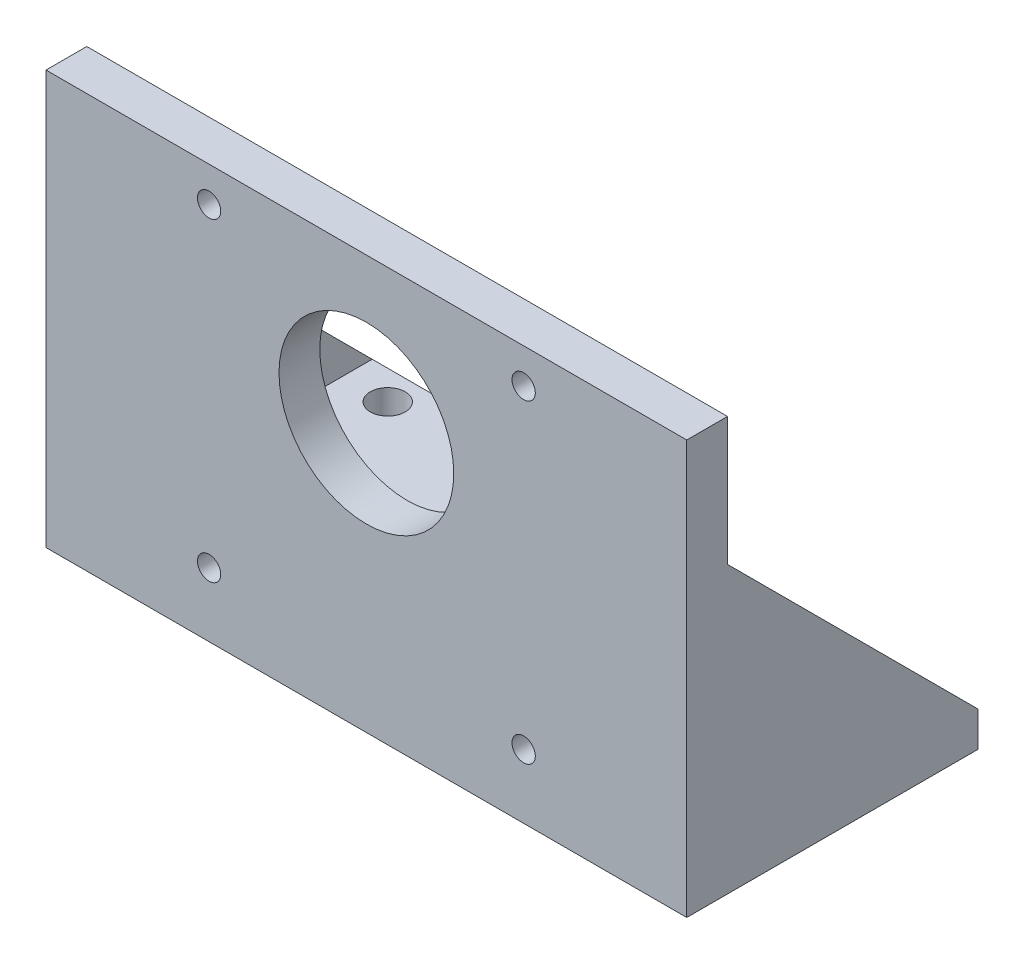
ISO-10303-21;
HEADER;
FILE_DESCRIPTION(('STEP AP214'),'2;1');
FILE_NAME('part.step','',(''),(''),'','','');
FILE_SCHEMA(('AUTOMOTIVE_DESIGN { 1 0 10303 214 1 1 1 1 }'));
ENDSEC;
DATA;
#1=APPLICATION_CONTEXT('core data for automotive mechanical design processes');
#2=APPLICATION_PROTOCOL_DEFINITION('international standard','automotive_design',2000,#1);
#3=PRODUCT_CONTEXT('',#1,'mechanical');
#4=PRODUCT('Part','Part','',(#3));
#5=PRODUCT_RELATED_PRODUCT_CATEGORY('part','',(#4));
#6=PRODUCT_DEFINITION_FORMATION('','',#4);
#7=PRODUCT_DEFINITION_CONTEXT('part definition',#1,'design');
#8=PRODUCT_DEFINITION('design','',#6,#7);
#9=PRODUCT_DEFINITION_SHAPE('','',#8);
#10=(LENGTH_UNIT() NAMED_UNIT(*) SI_UNIT(.MILLI.,.METRE.));
#11=(NAMED_UNIT(*) PLANE_ANGLE_UNIT() SI_UNIT($,.RADIAN.));
#12=(NAMED_UNIT(*) SI_UNIT($,.STERADIAN.) SOLID_ANGLE_UNIT());
#13=UNCERTAINTY_MEASURE_WITH_UNIT(LENGTH_MEASURE(1.E-05),#10,'distance_accuracy_value','');
#14=(GEOMETRIC_REPRESENTATION_CONTEXT(3) GLOBAL_UNCERTAINTY_ASSIGNED_CONTEXT((#13)) GLOBAL_UNIT_ASSIGNED_CONTEXT((#10,
#11,#12)) REPRESENTATION_CONTEXT('',''));
#15=CARTESIAN_POINT('',(0.,0.,0.));
#16=DIRECTION('',(0.,0.,1.));
#17=DIRECTION('',(1.,0.,0.));
#18=AXIS2_PLACEMENT_3D('',#15,#16,#17);
#19=CARTESIAN_POINT('',(0.,6.,0.));
#20=DIRECTION('',(0.,1.,0.));
#21=DIRECTION('',(0.,0.,1.));
#22=AXIS2_PLACEMENT_3D('',#19,#20,#21);
#23=PLANE('',#22);
#24=CARTESIAN_POINT('',(41.3296992436846,6.,-20.));
#25=DIRECTION('',(0.,1.,0.));
#26=DIRECTION('',(0.,0.,-1.));
#27=AXIS2_PLACEMENT_3D('',#24,#25,#26);
#28=CIRCLE('',#27,3.);
#29=CARTESIAN_POINT('',(41.3296992436846,6.,-23.));
#30=VERTEX_POINT('',#29);
#31=EDGE_CURVE('E222',#30,#30,#28,.T.);
#32=ORIENTED_EDGE('',*,*,#31,.F.);
#33=EDGE_LOOP('',(#32));
#34=FACE_BOUND('',#33,.T.);
#35=CARTESIAN_POINT('',(41.3296992436846,6.,13.));
#36=DIRECTION('',(0.,1.,0.));
#37=DIRECTION('',(0.,0.,-1.));
#38=AXIS2_PLACEMENT_3D('',#35,#36,#37);
#39=CIRCLE('',#38,3.);
#40=CARTESIAN_POINT('',(41.3296992436846,6.,10.));
#41=VERTEX_POINT('',#40);
#42=EDGE_CURVE('E216',#41,#41,#39,.T.);
#43=ORIENTED_EDGE('',*,*,#42,.F.);
#44=EDGE_LOOP('',(#43));
#45=FACE_BOUND('',#44,.T.);
#46=CARTESIAN_POINT('',(-41.3296992436846,6.,13.));
#47=DIRECTION('',(0.,1.,0.));
#48=DIRECTION('',(0.,0.,1.));
#49=AXIS2_PLACEMENT_3D('',#46,#47,#48);
#50=CIRCLE('',#49,3.);
#51=CARTESIAN_POINT('',(-41.3296992436846,6.,16.));
#52=VERTEX_POINT('',#51);
#53=EDGE_CURVE('E210',#52,#52,#50,.T.);
#54=ORIENTED_EDGE('',*,*,#53,.F.);
#55=EDGE_LOOP('',(#54));
#56=FACE_BOUND('',#55,.T.);
#57=CARTESIAN_POINT('',(-41.3296992436846,6.,-20.));
#58=DIRECTION('',(0.,1.,0.));
#59=DIRECTION('',(0.,0.,1.));
#60=AXIS2_PLACEMENT_3D('',#57,#58,#59);
#61=CIRCLE('',#60,3.);
#62=CARTESIAN_POINT('',(-41.3296992436846,6.,-17.));
#63=VERTEX_POINT('',#62);
#64=EDGE_CURVE('E204',#63,#63,#61,.T.);
#65=ORIENTED_EDGE('',*,*,#64,.F.);
#66=EDGE_LOOP('',(#65));
#67=FACE_BOUND('',#66,.T.);
#68=CARTESIAN_POINT('',(0.,6.,0.));
#69=DIRECTION('',(0.,1.,0.));
#70=DIRECTION('',(0.,0.,1.));
#71=AXIS2_PLACEMENT_3D('',#68,#69,#70);
#72=CIRCLE('',#71,17.5);
#73=CARTESIAN_POINT('',(0.,6.,17.5));
#74=VERTEX_POINT('',#73);
#75=EDGE_CURVE('E128',#74,#74,#72,.T.);
#76=ORIENTED_EDGE('',*,*,#75,.F.);
#77=EDGE_LOOP('',(#76));
#78=FACE_BOUND('',#77,.T.);
#79=DIRECTION('',(1.,0.,0.));
#80=VECTOR('',#79,1.);
#81=CARTESIAN_POINT('',(0.,6.,-25.));
#82=LINE('',#81,#80);
#83=CARTESIAN_POINT('',(-49.,6.,-25.));
#84=VERTEX_POINT('',#83);
#85=CARTESIAN_POINT('',(49.,6.,-25.));
#86=VERTEX_POINT('',#85);
#87=EDGE_CURVE('E51',#84,#86,#82,.T.);
#88=ORIENTED_EDGE('',*,*,#87,.F.);
#89=DIRECTION('',(0.,0.,1.));
#90=VECTOR('',#89,1.);
#91=CARTESIAN_POINT('',(-49.,6.,-25.));
#92=LINE('',#91,#90);
#93=CARTESIAN_POINT('',(-49.,6.,18.));
#94=VERTEX_POINT('',#93);
#95=EDGE_CURVE('E107',#84,#94,#92,.T.);
#96=ORIENTED_EDGE('',*,*,#95,.T.);
#97=DIRECTION('',(-1.,0.,0.));
#98=VECTOR('',#97,1.);
#99=CARTESIAN_POINT('',(-55.,6.,18.));
#100=LINE('',#99,#98);
#101=CARTESIAN_POINT('',(49.,6.,18.));
#102=VERTEX_POINT('',#101);
#103=EDGE_CURVE('E167',#102,#94,#100,.T.);
#104=ORIENTED_EDGE('',*,*,#103,.F.);
#105=DIRECTION('',(0.,0.,-1.));
#106=VECTOR('',#105,1.);
#107=CARTESIAN_POINT('',(49.,6.,18.));
#108=LINE('',#107,#106);
#109=EDGE_CURVE('E126',#102,#86,#108,.T.);
#110=ORIENTED_EDGE('',*,*,#109,.T.);
#111=EDGE_LOOP('',(#88,#96,#104,#110));
#112=FACE_BOUND('',#111,.T.);
#113=ADVANCED_FACE('F34',(#34,#45,#56,#67,#78,#112),#23,.T.);
#114=CARTESIAN_POINT('',(0.,6.,-25.));
#115=DIRECTION('',(0.,0.,-1.));
#116=DIRECTION('',(-1.,0.,0.));
#117=AXIS2_PLACEMENT_3D('',#114,#115,#116);
#118=PLANE('',#117);
#119=DIRECTION('',(1.,0.,0.));
#120=VECTOR('',#119,1.);
#121=CARTESIAN_POINT('',(0.,0.,-25.));
#122=LINE('',#121,#120);
#123=CARTESIAN_POINT('',(-55.,0.,-25.));
#124=VERTEX_POINT('',#123);
#125=CARTESIAN_POINT('',(55.,0.,-25.));
#126=VERTEX_POINT('',#125);
#127=EDGE_CURVE('E142',#124,#126,#122,.T.);
#128=ORIENTED_EDGE('',*,*,#127,.F.);
#129=DIRECTION('',(0.,-1.,0.));
#130=VECTOR('',#129,1.);
#131=CARTESIAN_POINT('',(-55.,6.,-25.));
#132=LINE('',#131,#130);
#133=CARTESIAN_POINT('',(-55.,6.,-25.));
#134=VERTEX_POINT('',#133);
#135=EDGE_CURVE('E11',#134,#124,#132,.T.);
#136=ORIENTED_EDGE('',*,*,#135,.F.);
#137=EDGE_CURVE('E119',#134,#84,#82,.T.);
#138=ORIENTED_EDGE('',*,*,#137,.T.);
#139=ORIENTED_EDGE('',*,*,#87,.T.);
#140=DIRECTION('',(1.,0.,0.));
#141=VECTOR('',#140,1.);
#142=CARTESIAN_POINT('',(49.,6.,-25.));
#143=LINE('',#142,#141);
#144=CARTESIAN_POINT('',(55.,6.,-25.));
#145=VERTEX_POINT('',#144);
#146=EDGE_CURVE('E182',#86,#145,#143,.T.);
#147=ORIENTED_EDGE('',*,*,#146,.T.);
#148=DIRECTION('',(0.,-1.,0.));
#149=VECTOR('',#148,1.);
#150=CARTESIAN_POINT('',(55.,6.,-25.));
#151=LINE('',#150,#149);
#152=EDGE_CURVE('E133',#145,#126,#151,.T.);
#153=ORIENTED_EDGE('',*,*,#152,.T.);
#154=EDGE_LOOP('',(#128,#136,#138,#139,#147,#153));
#155=FACE_BOUND('',#154,.T.);
#156=ADVANCED_FACE('F132',(#155),#118,.T.);
#157=CARTESIAN_POINT('',(-55.,6.,0.));
#158=DIRECTION('',(1.,0.,0.));
#159=DIRECTION('',(0.,0.,-1.));
#160=AXIS2_PLACEMENT_3D('',#157,#158,#159);
#161=PLANE('',#160);
#162=DIRECTION('',(0.,0.,1.));
#163=VECTOR('',#162,1.);
#164=CARTESIAN_POINT('',(-55.,0.,0.));
#165=LINE('',#164,#163);
#166=CARTESIAN_POINT('',(-55.,0.,25.));
#167=VERTEX_POINT('',#166);
#168=EDGE_CURVE('E146',#124,#167,#165,.T.);
#169=ORIENTED_EDGE('',*,*,#168,.T.);
#170=DIRECTION('',(0.,-1.,0.));
#171=VECTOR('',#170,1.);
#172=CARTESIAN_POINT('',(-55.,6.,25.));
#173=LINE('',#172,#171);
#174=CARTESIAN_POINT('',(-55.,71.,25.));
#175=VERTEX_POINT('',#174);
#176=EDGE_CURVE('E43',#175,#167,#173,.T.);
#177=ORIENTED_EDGE('',*,*,#176,.F.);
#178=DIRECTION('',(0.,0.,1.));
#179=VECTOR('',#178,1.);
#180=CARTESIAN_POINT('',(-55.,71.,25.));
#181=LINE('',#180,#179);
#182=CARTESIAN_POINT('',(-55.,71.,18.));
#183=VERTEX_POINT('',#182);
#184=EDGE_CURVE('E169',#183,#175,#181,.T.);
#185=ORIENTED_EDGE('',*,*,#184,.F.);
#186=DIRECTION('',(0.,-1.,0.));
#187=VECTOR('',#186,1.);
#188=CARTESIAN_POINT('',(-55.,71.,18.));
#189=LINE('',#188,#187);
#190=CARTESIAN_POINT('',(-55.,49.,18.));
#191=VERTEX_POINT('',#190);
#192=EDGE_CURVE('E158',#183,#191,#189,.T.);
#193=ORIENTED_EDGE('',*,*,#192,.T.);
#194=DIRECTION('',(0.,-0.707106781186547,-0.707106781186548));
#195=VECTOR('',#194,1.);
#196=CARTESIAN_POINT('',(-55.,49.,18.));
#197=LINE('',#196,#195);
#198=EDGE_CURVE('E123',#191,#134,#197,.T.);
#199=ORIENTED_EDGE('',*,*,#198,.T.);
#200=ORIENTED_EDGE('',*,*,#135,.T.);
#201=EDGE_LOOP('',(#169,#177,#185,#193,#199,#200));
#202=FACE_BOUND('',#201,.T.);
#203=ADVANCED_FACE('F264',(#202),#161,.F.);
#204=CARTESIAN_POINT('',(0.,6.,25.));
#205=DIRECTION('',(0.,0.,-1.));
#206=DIRECTION('',(-1.,0.,0.));
#207=AXIS2_PLACEMENT_3D('',#204,#205,#206);
#208=PLANE('',#207);
#209=CARTESIAN_POINT('',(27.,11.,25.));
#210=DIRECTION('',(0.,0.,1.));
#211=DIRECTION('',(1.,0.,0.));
#212=AXIS2_PLACEMENT_3D('',#209,#210,#211);
#213=CIRCLE('',#212,2.);
#214=CARTESIAN_POINT('',(29.,11.,25.));
#215=VERTEX_POINT('',#214);
#216=EDGE_CURVE('E238',#215,#215,#213,.T.);
#217=ORIENTED_EDGE('',*,*,#216,.F.);
#218=EDGE_LOOP('',(#217));
#219=FACE_BOUND('',#218,.T.);
#220=CARTESIAN_POINT('',(27.,65.,25.));
#221=DIRECTION('',(0.,0.,1.));
#222=DIRECTION('',(1.,0.,0.));
#223=AXIS2_PLACEMENT_3D('',#220,#221,#222);
#224=CIRCLE('',#223,2.);
#225=CARTESIAN_POINT('',(29.,65.,25.));
#226=VERTEX_POINT('',#225);
#227=EDGE_CURVE('E235',#226,#226,#224,.T.);
#228=ORIENTED_EDGE('',*,*,#227,.F.);
#229=EDGE_LOOP('',(#228));
#230=FACE_BOUND('',#229,.T.);
#231=CARTESIAN_POINT('',(-27.,65.,25.));
#232=DIRECTION('',(0.,0.,1.));
#233=DIRECTION('',(1.,0.,0.));
#234=AXIS2_PLACEMENT_3D('',#231,#232,#233);
#235=CIRCLE('',#234,2.);
#236=CARTESIAN_POINT('',(-25.,65.,25.));
#237=VERTEX_POINT('',#236);
#238=EDGE_CURVE('E231',#237,#237,#235,.T.);
#239=ORIENTED_EDGE('',*,*,#238,.F.);
#240=EDGE_LOOP('',(#239));
#241=FACE_BOUND('',#240,.T.);
#242=CARTESIAN_POINT('',(-27.,11.,25.));
#243=DIRECTION('',(0.,0.,1.));
#244=DIRECTION('',(1.,0.,0.));
#245=AXIS2_PLACEMENT_3D('',#242,#243,#244);
#246=CIRCLE('',#245,2.);
#247=CARTESIAN_POINT('',(-25.,11.,25.));
#248=VERTEX_POINT('',#247);
#249=EDGE_CURVE('E227',#248,#248,#246,.T.);
#250=ORIENTED_EDGE('',*,*,#249,.F.);
#251=EDGE_LOOP('',(#250));
#252=FACE_BOUND('',#251,.T.);
#253=CARTESIAN_POINT('',(0.,46.,25.));
#254=DIRECTION('',(0.,0.,1.));
#255=DIRECTION('',(1.,0.,0.));
#256=AXIS2_PLACEMENT_3D('',#253,#254,#255);
#257=CIRCLE('',#256,15.);
#258=CARTESIAN_POINT('',(15.,46.,25.));
#259=VERTEX_POINT('',#258);
#260=EDGE_CURVE('E200',#259,#259,#257,.T.);
#261=ORIENTED_EDGE('',*,*,#260,.F.);
#262=EDGE_LOOP('',(#261));
#263=FACE_BOUND('',#262,.T.);
#264=DIRECTION('',(1.,0.,0.));
#265=VECTOR('',#264,1.);
#266=CARTESIAN_POINT('',(0.,0.,25.));
#267=LINE('',#266,#265);
#268=CARTESIAN_POINT('',(55.,0.,25.));
#269=VERTEX_POINT('',#268);
#270=EDGE_CURVE('E149',#167,#269,#267,.T.);
#271=ORIENTED_EDGE('',*,*,#270,.T.);
#272=DIRECTION('',(0.,-1.,0.));
#273=VECTOR('',#272,1.);
#274=CARTESIAN_POINT('',(55.,6.,25.));
#275=LINE('',#274,#273);
#276=CARTESIAN_POINT('',(55.,71.,25.));
#277=VERTEX_POINT('',#276);
#278=EDGE_CURVE('E134',#277,#269,#275,.T.);
#279=ORIENTED_EDGE('',*,*,#278,.F.);
#280=DIRECTION('',(1.,0.,0.));
#281=VECTOR('',#280,1.);
#282=CARTESIAN_POINT('',(-55.,71.,25.));
#283=LINE('',#282,#281);
#284=EDGE_CURVE('E177',#175,#277,#283,.T.);
#285=ORIENTED_EDGE('',*,*,#284,.F.);
#286=ORIENTED_EDGE('',*,*,#176,.T.);
#287=EDGE_LOOP('',(#271,#279,#285,#286));
#288=FACE_BOUND('',#287,.T.);
#289=ADVANCED_FACE('F278',(#219,#230,#241,#252,#263,#288),#208,.F.);
#290=CARTESIAN_POINT('',(0.,6.,0.));
#291=DIRECTION('',(0.,-1.,0.));
#292=DIRECTION('',(0.,0.,-1.));
#293=AXIS2_PLACEMENT_3D('',#290,#291,#292);
#294=CYLINDRICAL_SURFACE('',#293,17.5);
#295=ORIENTED_EDGE('',*,*,#75,.T.);
#296=EDGE_LOOP('',(#295));
#297=FACE_BOUND('',#296,.T.);
#298=CARTESIAN_POINT('',(0.,0.,0.));
#299=DIRECTION('',(0.,1.,0.));
#300=DIRECTION('',(0.,0.,1.));
#301=AXIS2_PLACEMENT_3D('',#298,#299,#300);
#302=CIRCLE('',#301,17.5);
#303=CARTESIAN_POINT('',(0.,0.,17.5));
#304=VERTEX_POINT('',#303);
#305=EDGE_CURVE('E139',#304,#304,#302,.T.);
#306=ORIENTED_EDGE('',*,*,#305,.F.);
#307=EDGE_LOOP('',(#306));
#308=FACE_BOUND('',#307,.T.);
#309=ADVANCED_FACE('F36',(#297,#308),#294,.F.);
#310=CARTESIAN_POINT('',(55.,6.,0.));
#311=DIRECTION('',(1.,0.,0.));
#312=DIRECTION('',(0.,0.,-1.));
#313=AXIS2_PLACEMENT_3D('',#310,#311,#312);
#314=PLANE('',#313);
#315=DIRECTION('',(0.,0.,1.));
#316=VECTOR('',#315,1.);
#317=CARTESIAN_POINT('',(55.,0.,0.));
#318=LINE('',#317,#316);
#319=EDGE_CURVE('E152',#126,#269,#318,.T.);
#320=ORIENTED_EDGE('',*,*,#319,.F.);
#321=ORIENTED_EDGE('',*,*,#152,.F.);
#322=DIRECTION('',(0.,0.707106781186547,0.707106781186548));
#323=VECTOR('',#322,1.);
#324=CARTESIAN_POINT('',(55.,49.,18.));
#325=LINE('',#324,#323);
#326=CARTESIAN_POINT('',(55.,49.,18.));
#327=VERTEX_POINT('',#326);
#328=EDGE_CURVE('E186',#145,#327,#325,.T.);
#329=ORIENTED_EDGE('',*,*,#328,.T.);
#330=DIRECTION('',(0.,-1.,0.));
#331=VECTOR('',#330,1.);
#332=CARTESIAN_POINT('',(55.,71.,18.));
#333=LINE('',#332,#331);
#334=CARTESIAN_POINT('',(55.,71.,18.));
#335=VERTEX_POINT('',#334);
#336=EDGE_CURVE('E143',#335,#327,#333,.T.);
#337=ORIENTED_EDGE('',*,*,#336,.F.);
#338=DIRECTION('',(0.,0.,-1.));
#339=VECTOR('',#338,1.);
#340=CARTESIAN_POINT('',(55.,71.,25.));
#341=LINE('',#340,#339);
#342=EDGE_CURVE('E175',#277,#335,#341,.T.);
#343=ORIENTED_EDGE('',*,*,#342,.F.);
#344=ORIENTED_EDGE('',*,*,#278,.T.);
#345=EDGE_LOOP('',(#320,#321,#329,#337,#343,#344));
#346=FACE_BOUND('',#345,.T.);
#347=ADVANCED_FACE('F273',(#346),#314,.T.);
#348=CARTESIAN_POINT('',(0.,0.,0.));
#349=DIRECTION('',(0.,1.,0.));
#350=DIRECTION('',(0.,0.,1.));
#351=AXIS2_PLACEMENT_3D('',#348,#349,#350);
#352=PLANE('',#351);
#353=CARTESIAN_POINT('',(41.3296992436846,0.,-20.));
#354=DIRECTION('',(0.,1.,0.));
#355=DIRECTION('',(0.,0.,-1.));
#356=AXIS2_PLACEMENT_3D('',#353,#354,#355);
#357=CIRCLE('',#356,3.);
#358=CARTESIAN_POINT('',(41.3296992436846,0.,-23.));
#359=VERTEX_POINT('',#358);
#360=EDGE_CURVE('E219',#359,#359,#357,.T.);
#361=ORIENTED_EDGE('',*,*,#360,.T.);
#362=EDGE_LOOP('',(#361));
#363=FACE_BOUND('',#362,.T.);
#364=CARTESIAN_POINT('',(41.3296992436846,0.,13.));
#365=DIRECTION('',(0.,1.,0.));
#366=DIRECTION('',(0.,0.,-1.));
#367=AXIS2_PLACEMENT_3D('',#364,#365,#366);
#368=CIRCLE('',#367,3.);
#369=CARTESIAN_POINT('',(41.3296992436846,0.,10.));
#370=VERTEX_POINT('',#369);
#371=EDGE_CURVE('E213',#370,#370,#368,.T.);
#372=ORIENTED_EDGE('',*,*,#371,.T.);
#373=EDGE_LOOP('',(#372));
#374=FACE_BOUND('',#373,.T.);
#375=CARTESIAN_POINT('',(-41.3296992436846,0.,13.));
#376=DIRECTION('',(0.,1.,0.));
#377=DIRECTION('',(0.,0.,1.));
#378=AXIS2_PLACEMENT_3D('',#375,#376,#377);
#379=CIRCLE('',#378,3.);
#380=CARTESIAN_POINT('',(-41.3296992436846,0.,16.));
#381=VERTEX_POINT('',#380);
#382=EDGE_CURVE('E207',#381,#381,#379,.T.);
#383=ORIENTED_EDGE('',*,*,#382,.T.);
#384=EDGE_LOOP('',(#383));
#385=FACE_BOUND('',#384,.T.);
#386=CARTESIAN_POINT('',(-41.3296992436846,0.,-20.));
#387=DIRECTION('',(0.,1.,0.));
#388=DIRECTION('',(0.,0.,1.));
#389=AXIS2_PLACEMENT_3D('',#386,#387,#388);
#390=CIRCLE('',#389,3.);
#391=CARTESIAN_POINT('',(-41.3296992436846,0.,-17.));
#392=VERTEX_POINT('',#391);
#393=EDGE_CURVE('E203',#392,#392,#390,.T.);
#394=ORIENTED_EDGE('',*,*,#393,.T.);
#395=EDGE_LOOP('',(#394));
#396=FACE_BOUND('',#395,.T.);
#397=ORIENTED_EDGE('',*,*,#305,.T.);
#398=EDGE_LOOP('',(#397));
#399=FACE_BOUND('',#398,.T.);
#400=ORIENTED_EDGE('',*,*,#127,.T.);
#401=ORIENTED_EDGE('',*,*,#319,.T.);
#402=ORIENTED_EDGE('',*,*,#270,.F.);
#403=ORIENTED_EDGE('',*,*,#168,.F.);
#404=EDGE_LOOP('',(#400,#401,#402,#403));
#405=FACE_BOUND('',#404,.T.);
#406=ADVANCED_FACE('F270',(#363,#374,#385,#396,#399,#405),#352,.F.);
#407=CARTESIAN_POINT('',(-55.,71.,18.));
#408=DIRECTION('',(0.,0.,1.));
#409=DIRECTION('',(1.,0.,0.));
#410=AXIS2_PLACEMENT_3D('',#407,#408,#409);
#411=PLANE('',#410);
#412=CARTESIAN_POINT('',(27.,11.,18.));
#413=DIRECTION('',(0.,0.,1.));
#414=DIRECTION('',(1.,0.,0.));
#415=AXIS2_PLACEMENT_3D('',#412,#413,#414);
#416=CIRCLE('',#415,2.);
#417=CARTESIAN_POINT('',(29.,11.,18.));
#418=VERTEX_POINT('',#417);
#419=EDGE_CURVE('E38',#418,#418,#416,.T.);
#420=ORIENTED_EDGE('',*,*,#419,.T.);
#421=EDGE_LOOP('',(#420));
#422=FACE_BOUND('',#421,.T.);
#423=CARTESIAN_POINT('',(27.,65.,18.));
#424=DIRECTION('',(0.,0.,1.));
#425=DIRECTION('',(1.,0.,0.));
#426=AXIS2_PLACEMENT_3D('',#423,#424,#425);
#427=CIRCLE('',#426,2.);
#428=CARTESIAN_POINT('',(29.,65.,18.));
#429=VERTEX_POINT('',#428);
#430=EDGE_CURVE('E234',#429,#429,#427,.T.);
#431=ORIENTED_EDGE('',*,*,#430,.T.);
#432=EDGE_LOOP('',(#431));
#433=FACE_BOUND('',#432,.T.);
#434=CARTESIAN_POINT('',(-27.,65.,18.));
#435=DIRECTION('',(0.,0.,1.));
#436=DIRECTION('',(1.,0.,0.));
#437=AXIS2_PLACEMENT_3D('',#434,#435,#436);
#438=CIRCLE('',#437,2.);
#439=CARTESIAN_POINT('',(-25.,65.,18.));
#440=VERTEX_POINT('',#439);
#441=EDGE_CURVE('E230',#440,#440,#438,.T.);
#442=ORIENTED_EDGE('',*,*,#441,.T.);
#443=EDGE_LOOP('',(#442));
#444=FACE_BOUND('',#443,.T.);
#445=CARTESIAN_POINT('',(-27.,11.,18.));
#446=DIRECTION('',(0.,0.,1.));
#447=DIRECTION('',(1.,0.,0.));
#448=AXIS2_PLACEMENT_3D('',#445,#446,#447);
#449=CIRCLE('',#448,2.);
#450=CARTESIAN_POINT('',(-25.,11.,18.));
#451=VERTEX_POINT('',#450);
#452=EDGE_CURVE('E170',#451,#451,#449,.T.);
#453=ORIENTED_EDGE('',*,*,#452,.T.);
#454=EDGE_LOOP('',(#453));
#455=FACE_BOUND('',#454,.T.);
#456=CARTESIAN_POINT('',(0.,46.,18.));
#457=DIRECTION('',(0.,0.,1.));
#458=DIRECTION('',(1.,0.,0.));
#459=AXIS2_PLACEMENT_3D('',#456,#457,#458);
#460=CIRCLE('',#459,15.);
#461=CARTESIAN_POINT('',(15.,46.,18.));
#462=VERTEX_POINT('',#461);
#463=EDGE_CURVE('E196',#462,#462,#460,.F.);
#464=ORIENTED_EDGE('',*,*,#463,.F.);
#465=EDGE_LOOP('',(#464));
#466=FACE_BOUND('',#465,.T.);
#467=DIRECTION('',(0.,1.,0.));
#468=VECTOR('',#467,1.);
#469=CARTESIAN_POINT('',(-49.,6.,18.));
#470=LINE('',#469,#468);
#471=CARTESIAN_POINT('',(-49.,49.,18.));
#472=VERTEX_POINT('',#471);
#473=EDGE_CURVE('E112',#94,#472,#470,.T.);
#474=ORIENTED_EDGE('',*,*,#473,.T.);
#475=DIRECTION('',(-1.,0.,0.));
#476=VECTOR('',#475,1.);
#477=CARTESIAN_POINT('',(-49.,49.,18.));
#478=LINE('',#477,#476);
#479=EDGE_CURVE('E122',#472,#191,#478,.T.);
#480=ORIENTED_EDGE('',*,*,#479,.T.);
#481=ORIENTED_EDGE('',*,*,#192,.F.);
#482=DIRECTION('',(-1.,0.,0.));
#483=VECTOR('',#482,1.);
#484=CARTESIAN_POINT('',(-55.,71.,18.));
#485=LINE('',#484,#483);
#486=EDGE_CURVE('E161',#335,#183,#485,.T.);
#487=ORIENTED_EDGE('',*,*,#486,.F.);
#488=ORIENTED_EDGE('',*,*,#336,.T.);
#489=DIRECTION('',(1.,0.,0.));
#490=VECTOR('',#489,1.);
#491=CARTESIAN_POINT('',(49.,49.,18.));
#492=LINE('',#491,#490);
#493=CARTESIAN_POINT('',(49.,49.,18.));
#494=VERTEX_POINT('',#493);
#495=EDGE_CURVE('E59',#494,#327,#492,.T.);
#496=ORIENTED_EDGE('',*,*,#495,.F.);
#497=DIRECTION('',(0.,-1.,0.));
#498=VECTOR('',#497,1.);
#499=CARTESIAN_POINT('',(49.,6.,18.));
#500=LINE('',#499,#498);
#501=EDGE_CURVE('E189',#494,#102,#500,.T.);
#502=ORIENTED_EDGE('',*,*,#501,.T.);
#503=ORIENTED_EDGE('',*,*,#103,.T.);
#504=EDGE_LOOP('',(#474,#480,#481,#487,#488,#496,#502,#503));
#505=FACE_BOUND('',#504,.T.);
#506=ADVANCED_FACE('F245',(#422,#433,#444,#455,#466,#505),#411,.F.);
#507=CARTESIAN_POINT('',(0.,71.,0.));
#508=DIRECTION('',(0.,-1.,0.));
#509=DIRECTION('',(0.,0.,-1.));
#510=AXIS2_PLACEMENT_3D('',#507,#508,#509);
#511=PLANE('',#510);
#512=ORIENTED_EDGE('',*,*,#184,.T.);
#513=ORIENTED_EDGE('',*,*,#284,.T.);
#514=ORIENTED_EDGE('',*,*,#342,.T.);
#515=ORIENTED_EDGE('',*,*,#486,.T.);
#516=EDGE_LOOP('',(#512,#513,#514,#515));
#517=FACE_BOUND('',#516,.T.);
#518=ADVANCED_FACE('F302',(#517),#511,.F.);
#519=CARTESIAN_POINT('',(49.,49.,18.));
#520=DIRECTION('',(0.,0.707106781186548,-0.707106781186547));
#521=DIRECTION('',(0.,0.707106781186547,0.707106781186548));
#522=AXIS2_PLACEMENT_3D('',#519,#520,#521);
#523=PLANE('',#522);
#524=ORIENTED_EDGE('',*,*,#328,.F.);
#525=ORIENTED_EDGE('',*,*,#146,.F.);
#526=DIRECTION('',(0.,0.707106781186547,0.707106781186548));
#527=VECTOR('',#526,1.);
#528=CARTESIAN_POINT('',(49.,49.,18.));
#529=LINE('',#528,#527);
#530=EDGE_CURVE('E184',#86,#494,#529,.T.);
#531=ORIENTED_EDGE('',*,*,#530,.T.);
#532=ORIENTED_EDGE('',*,*,#495,.T.);
#533=EDGE_LOOP('',(#524,#525,#531,#532));
#534=FACE_BOUND('',#533,.T.);
#535=ADVANCED_FACE('F295',(#534),#523,.T.);
#536=CARTESIAN_POINT('',(49.,0.,0.));
#537=DIRECTION('',(-1.,0.,0.));
#538=DIRECTION('',(0.,0.,1.));
#539=AXIS2_PLACEMENT_3D('',#536,#537,#538);
#540=PLANE('',#539);
#541=ORIENTED_EDGE('',*,*,#501,.F.);
#542=ORIENTED_EDGE('',*,*,#530,.F.);
#543=ORIENTED_EDGE('',*,*,#109,.F.);
#544=EDGE_LOOP('',(#541,#542,#543));
#545=FACE_BOUND('',#544,.T.);
#546=ADVANCED_FACE('F298',(#545),#540,.T.);
#547=CARTESIAN_POINT('',(-49.,49.,18.));
#548=DIRECTION('',(0.,0.707106781186548,-0.707106781186547));
#549=DIRECTION('',(0.,0.707106781186547,0.707106781186548));
#550=AXIS2_PLACEMENT_3D('',#547,#548,#549);
#551=PLANE('',#550);
#552=ORIENTED_EDGE('',*,*,#198,.F.);
#553=ORIENTED_EDGE('',*,*,#479,.F.);
#554=DIRECTION('',(0.,-0.707106781186547,-0.707106781186548));
#555=VECTOR('',#554,1.);
#556=CARTESIAN_POINT('',(-49.,49.,18.));
#557=LINE('',#556,#555);
#558=EDGE_CURVE('E110',#472,#84,#557,.T.);
#559=ORIENTED_EDGE('',*,*,#558,.T.);
#560=ORIENTED_EDGE('',*,*,#137,.F.);
#561=EDGE_LOOP('',(#552,#553,#559,#560));
#562=FACE_BOUND('',#561,.T.);
#563=ADVANCED_FACE('F118',(#562),#551,.T.);
#564=CARTESIAN_POINT('',(-49.,0.,0.));
#565=DIRECTION('',(-1.,0.,0.));
#566=DIRECTION('',(0.,0.,1.));
#567=AXIS2_PLACEMENT_3D('',#564,#565,#566);
#568=PLANE('',#567);
#569=ORIENTED_EDGE('',*,*,#558,.F.);
#570=ORIENTED_EDGE('',*,*,#473,.F.);
#571=ORIENTED_EDGE('',*,*,#95,.F.);
#572=EDGE_LOOP('',(#569,#570,#571));
#573=FACE_BOUND('',#572,.T.);
#574=ADVANCED_FACE('F109',(#573),#568,.F.);
#575=CARTESIAN_POINT('',(0.,46.,-25.001));
#576=DIRECTION('',(0.,0.,1.));
#577=DIRECTION('',(1.,0.,0.));
#578=AXIS2_PLACEMENT_3D('',#575,#576,#577);
#579=CYLINDRICAL_SURFACE('',#578,15.);
#580=ORIENTED_EDGE('',*,*,#260,.T.);
#581=EDGE_LOOP('',(#580));
#582=FACE_BOUND('',#581,.T.);
#583=ORIENTED_EDGE('',*,*,#463,.T.);
#584=EDGE_LOOP('',(#583));
#585=FACE_BOUND('',#584,.T.);
#586=ADVANCED_FACE('F318',(#582,#585),#579,.F.);
#587=CARTESIAN_POINT('',(-41.3296992436846,0.,-20.));
#588=DIRECTION('',(0.,1.,0.));
#589=DIRECTION('',(0.,0.,1.));
#590=AXIS2_PLACEMENT_3D('',#587,#588,#589);
#591=CYLINDRICAL_SURFACE('',#590,3.);
#592=ORIENTED_EDGE('',*,*,#393,.F.);
#593=EDGE_LOOP('',(#592));
#594=FACE_BOUND('',#593,.T.);
#595=ORIENTED_EDGE('',*,*,#64,.T.);
#596=EDGE_LOOP('',(#595));
#597=FACE_BOUND('',#596,.T.);
#598=ADVANCED_FACE('F321',(#594,#597),#591,.F.);
#599=CARTESIAN_POINT('',(-41.3296992436846,0.,13.));
#600=DIRECTION('',(0.,1.,0.));
#601=DIRECTION('',(0.,0.,1.));
#602=AXIS2_PLACEMENT_3D('',#599,#600,#601);
#603=CYLINDRICAL_SURFACE('',#602,3.);
#604=ORIENTED_EDGE('',*,*,#382,.F.);
#605=EDGE_LOOP('',(#604));
#606=FACE_BOUND('',#605,.T.);
#607=ORIENTED_EDGE('',*,*,#53,.T.);
#608=EDGE_LOOP('',(#607));
#609=FACE_BOUND('',#608,.T.);
#610=ADVANCED_FACE('F325',(#606,#609),#603,.F.);
#611=CARTESIAN_POINT('',(41.3296992436846,0.,13.));
#612=DIRECTION('',(0.,1.,0.));
#613=DIRECTION('',(0.,0.,1.));
#614=AXIS2_PLACEMENT_3D('',#611,#612,#613);
#615=CYLINDRICAL_SURFACE('',#614,3.);
#616=ORIENTED_EDGE('',*,*,#371,.F.);
#617=EDGE_LOOP('',(#616));
#618=FACE_BOUND('',#617,.T.);
#619=ORIENTED_EDGE('',*,*,#42,.T.);
#620=EDGE_LOOP('',(#619));
#621=FACE_BOUND('',#620,.T.);
#622=ADVANCED_FACE('F329',(#618,#621),#615,.F.);
#623=CARTESIAN_POINT('',(41.3296992436846,0.,-20.));
#624=DIRECTION('',(0.,1.,0.));
#625=DIRECTION('',(0.,0.,1.));
#626=AXIS2_PLACEMENT_3D('',#623,#624,#625);
#627=CYLINDRICAL_SURFACE('',#626,3.);
#628=ORIENTED_EDGE('',*,*,#360,.F.);
#629=EDGE_LOOP('',(#628));
#630=FACE_BOUND('',#629,.T.);
#631=ORIENTED_EDGE('',*,*,#31,.T.);
#632=EDGE_LOOP('',(#631));
#633=FACE_BOUND('',#632,.T.);
#634=ADVANCED_FACE('F333',(#630,#633),#627,.F.);
#635=CARTESIAN_POINT('',(-27.,11.,-25.));
#636=DIRECTION('',(0.,0.,1.));
#637=DIRECTION('',(1.,0.,0.));
#638=AXIS2_PLACEMENT_3D('',#635,#636,#637);
#639=CYLINDRICAL_SURFACE('',#638,2.);
#640=ORIENTED_EDGE('',*,*,#249,.T.);
#641=EDGE_LOOP('',(#640));
#642=FACE_BOUND('',#641,.T.);
#643=ORIENTED_EDGE('',*,*,#452,.F.);
#644=EDGE_LOOP('',(#643));
#645=FACE_BOUND('',#644,.T.);
#646=ADVANCED_FACE('F337',(#642,#645),#639,.F.);
#647=CARTESIAN_POINT('',(-27.,65.,-25.));
#648=DIRECTION('',(0.,0.,1.));
#649=DIRECTION('',(1.,0.,0.));
#650=AXIS2_PLACEMENT_3D('',#647,#648,#649);
#651=CYLINDRICAL_SURFACE('',#650,2.);
#652=ORIENTED_EDGE('',*,*,#238,.T.);
#653=EDGE_LOOP('',(#652));
#654=FACE_BOUND('',#653,.T.);
#655=ORIENTED_EDGE('',*,*,#441,.F.);
#656=EDGE_LOOP('',(#655));
#657=FACE_BOUND('',#656,.T.);
#658=ADVANCED_FACE('F255',(#654,#657),#651,.F.);
#659=CARTESIAN_POINT('',(27.,65.,-25.));
#660=DIRECTION('',(0.,0.,1.));
#661=DIRECTION('',(1.,0.,0.));
#662=AXIS2_PLACEMENT_3D('',#659,#660,#661);
#663=CYLINDRICAL_SURFACE('',#662,2.);
#664=ORIENTED_EDGE('',*,*,#227,.T.);
#665=EDGE_LOOP('',(#664));
#666=FACE_BOUND('',#665,.T.);
#667=ORIENTED_EDGE('',*,*,#430,.F.);
#668=EDGE_LOOP('',(#667));
#669=FACE_BOUND('',#668,.T.);
#670=ADVANCED_FACE('F250',(#666,#669),#663,.F.);
#671=CARTESIAN_POINT('',(27.,11.,-25.));
#672=DIRECTION('',(0.,0.,1.));
#673=DIRECTION('',(1.,0.,0.));
#674=AXIS2_PLACEMENT_3D('',#671,#672,#673);
#675=CYLINDRICAL_SURFACE('',#674,2.);
#676=ORIENTED_EDGE('',*,*,#216,.T.);
#677=EDGE_LOOP('',(#676));
#678=FACE_BOUND('',#677,.T.);
#679=ORIENTED_EDGE('',*,*,#419,.F.);
#680=EDGE_LOOP('',(#679));
#681=FACE_BOUND('',#680,.T.);
#682=ADVANCED_FACE('F248',(#678,#681),#675,.F.);
#683=CLOSED_SHELL('',(#113,#156,#203,#289,#309,#347,#406,#506,#518,#535,#546,#563,#574,#586,
#598,#610,#622,#634,#646,#658,#670,#682));
#684=MANIFOLD_SOLID_BREP('B2',#683);
#685=ADVANCED_BREP_SHAPE_REPRESENTATION('',(#18,#684),#14);
#686=SHAPE_DEFINITION_REPRESENTATION(#9,#685);
ENDSEC;
END-ISO-10303-21;
